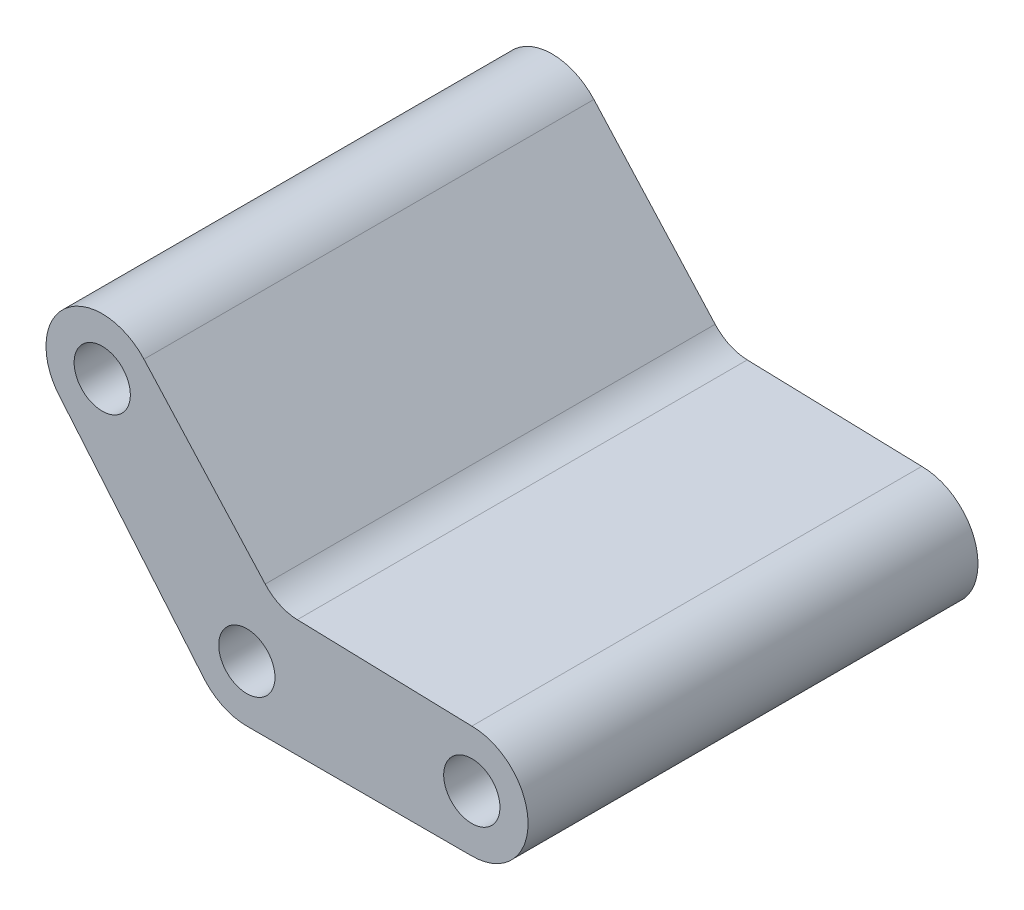
ISO-10303-21;
HEADER;
FILE_DESCRIPTION(('STEP AP214'),'2;1');
FILE_NAME('part.step','',(''),(''),'','','');
FILE_SCHEMA(('AUTOMOTIVE_DESIGN { 1 0 10303 214 1 1 1 1 }'));
ENDSEC;
DATA;
#1=APPLICATION_CONTEXT('core data for automotive mechanical design processes');
#2=APPLICATION_PROTOCOL_DEFINITION('international standard','automotive_design',2000,#1);
#3=PRODUCT_CONTEXT('',#1,'mechanical');
#4=PRODUCT('Part','Part','',(#3));
#5=PRODUCT_RELATED_PRODUCT_CATEGORY('part','',(#4));
#6=PRODUCT_DEFINITION_FORMATION('','',#4);
#7=PRODUCT_DEFINITION_CONTEXT('part definition',#1,'design');
#8=PRODUCT_DEFINITION('design','',#6,#7);
#9=PRODUCT_DEFINITION_SHAPE('','',#8);
#10=(LENGTH_UNIT() NAMED_UNIT(*) SI_UNIT(.MILLI.,.METRE.));
#11=(NAMED_UNIT(*) PLANE_ANGLE_UNIT() SI_UNIT($,.RADIAN.));
#12=(NAMED_UNIT(*) SI_UNIT($,.STERADIAN.) SOLID_ANGLE_UNIT());
#13=UNCERTAINTY_MEASURE_WITH_UNIT(LENGTH_MEASURE(1.E-05),#10,'distance_accuracy_value','');
#14=(GEOMETRIC_REPRESENTATION_CONTEXT(3) GLOBAL_UNCERTAINTY_ASSIGNED_CONTEXT((#13)) GLOBAL_UNIT_ASSIGNED_CONTEXT((#10,
#11,#12)) REPRESENTATION_CONTEXT('',''));
#15=CARTESIAN_POINT('',(0.,0.,0.));
#16=DIRECTION('',(0.,0.,1.));
#17=DIRECTION('',(1.,0.,0.));
#18=AXIS2_PLACEMENT_3D('',#15,#16,#17);
#19=CARTESIAN_POINT('',(45.9859991038776,94.3607755038972,400.));
#20=DIRECTION('',(0.,0.,-1.));
#21=DIRECTION('',(-1.,0.,0.));
#22=AXIS2_PLACEMENT_3D('',#19,#20,#21);
#23=CYLINDRICAL_SURFACE('',#22,40.);
#24=CARTESIAN_POINT('',(45.9859991038776,94.3607755038972,0.));
#25=DIRECTION('',(0.,0.,1.));
#26=DIRECTION('',(1.,0.,0.));
#27=AXIS2_PLACEMENT_3D('',#24,#25,#26);
#28=CIRCLE('',#27,40.);
#29=CARTESIAN_POINT('',(16.3159342561043,67.5337881231097,0.));
#30=VERTEX_POINT('',#29);
#31=CARTESIAN_POINT('',(44.858014963446,54.3766830197737,0.));
#32=VERTEX_POINT('',#31);
#33=EDGE_CURVE('E138',#30,#32,#28,.T.);
#34=ORIENTED_EDGE('',*,*,#33,.F.);
#35=DIRECTION('',(0.,0.,-1.));
#36=VECTOR('',#35,1.);
#37=CARTESIAN_POINT('',(16.3159342561043,67.5337881231097,400.));
#38=LINE('',#37,#36);
#39=CARTESIAN_POINT('',(16.3159342561043,67.5337881231097,400.));
#40=VERTEX_POINT('',#39);
#41=EDGE_CURVE('E11',#40,#30,#38,.T.);
#42=ORIENTED_EDGE('',*,*,#41,.F.);
#43=CARTESIAN_POINT('',(45.9859991038776,94.3607755038972,400.));
#44=DIRECTION('',(0.,0.,1.));
#45=DIRECTION('',(1.,0.,0.));
#46=AXIS2_PLACEMENT_3D('',#43,#44,#45);
#47=CIRCLE('',#46,40.);
#48=CARTESIAN_POINT('',(44.858014963446,54.3766830197737,400.));
#49=VERTEX_POINT('',#48);
#50=EDGE_CURVE('E165',#40,#49,#47,.T.);
#51=ORIENTED_EDGE('',*,*,#50,.T.);
#52=DIRECTION('',(0.,0.,-1.));
#53=VECTOR('',#52,1.);
#54=CARTESIAN_POINT('',(44.858014963446,54.3766830197737,400.));
#55=LINE('',#54,#53);
#56=EDGE_CURVE('E49',#49,#32,#55,.T.);
#57=ORIENTED_EDGE('',*,*,#56,.T.);
#58=EDGE_LOOP('',(#34,#42,#51,#57));
#59=FACE_BOUND('',#58,.T.);
#60=ADVANCED_FACE('F33',(#59),#23,.F.);
#61=CARTESIAN_POINT('',(42.5732591215961,38.4937576332859,400.));
#62=DIRECTION('',(-0.74175162119433,-0.670674684519689,0.));
#63=DIRECTION('',(0.670674684519689,-0.74175162119433,0.));
#64=AXIS2_PLACEMENT_3D('',#61,#62,#63);
#65=PLANE('',#64);
#66=DIRECTION('',(-0.670674684519689,0.74175162119433,0.));
#67=VECTOR('',#66,1.);
#68=CARTESIAN_POINT('',(42.5732591215961,38.4937576332859,0.));
#69=LINE('',#68,#67);
#70=CARTESIAN_POINT('',(-91.469940877592,186.742622849779,0.));
#71=VERTEX_POINT('',#70);
#72=EDGE_CURVE('E140',#30,#71,#69,.T.);
#73=ORIENTED_EDGE('',*,*,#72,.T.);
#74=DIRECTION('',(0.,0.,-1.));
#75=VECTOR('',#74,1.);
#76=CARTESIAN_POINT('',(-91.469940877592,186.742622849779,400.));
#77=LINE('',#76,#75);
#78=CARTESIAN_POINT('',(-91.469940877592,186.742622849779,400.));
#79=VERTEX_POINT('',#78);
#80=EDGE_CURVE('E41',#79,#71,#77,.T.);
#81=ORIENTED_EDGE('',*,*,#80,.F.);
#82=DIRECTION('',(-0.670674684519689,0.74175162119433,0.));
#83=VECTOR('',#82,1.);
#84=CARTESIAN_POINT('',(42.5732591215961,38.4937576332859,400.));
#85=LINE('',#84,#83);
#86=EDGE_CURVE('E192',#40,#79,#85,.T.);
#87=ORIENTED_EDGE('',*,*,#86,.F.);
#88=ORIENTED_EDGE('',*,*,#41,.T.);
#89=EDGE_LOOP('',(#73,#81,#87,#88));
#90=FACE_BOUND('',#89,.T.);
#91=ADVANCED_FACE('F212',(#90),#65,.F.);
#92=CARTESIAN_POINT('',(-128.557521937309,153.208888623795,400.));
#93=DIRECTION('',(0.,0.,-1.));
#94=DIRECTION('',(-1.,0.,0.));
#95=AXIS2_PLACEMENT_3D('',#92,#93,#94);
#96=CYLINDRICAL_SURFACE('',#95,50.);
#97=CARTESIAN_POINT('',(-128.557521937309,153.208888623795,0.));
#98=DIRECTION('',(0.,0.,1.));
#99=DIRECTION('',(1.,0.,0.));
#100=AXIS2_PLACEMENT_3D('',#97,#98,#99);
#101=CIRCLE('',#100,50.);
#102=CARTESIAN_POINT('',(-165.645102997025,119.675154397811,0.));
#103=VERTEX_POINT('',#102);
#104=EDGE_CURVE('E142',#71,#103,#101,.T.);
#105=ORIENTED_EDGE('',*,*,#104,.T.);
#106=DIRECTION('',(0.,0.,-1.));
#107=VECTOR('',#106,1.);
#108=CARTESIAN_POINT('',(-165.645102997025,119.675154397811,400.));
#109=LINE('',#108,#107);
#110=CARTESIAN_POINT('',(-165.645102997025,119.675154397811,400.));
#111=VERTEX_POINT('',#110);
#112=EDGE_CURVE('E171',#111,#103,#109,.T.);
#113=ORIENTED_EDGE('',*,*,#112,.F.);
#114=CARTESIAN_POINT('',(-128.557521937309,153.208888623795,400.));
#115=DIRECTION('',(0.,0.,1.));
#116=DIRECTION('',(1.,0.,0.));
#117=AXIS2_PLACEMENT_3D('',#114,#115,#116);
#118=CIRCLE('',#117,50.);
#119=EDGE_CURVE('E179',#79,#111,#118,.T.);
#120=ORIENTED_EDGE('',*,*,#119,.F.);
#121=ORIENTED_EDGE('',*,*,#80,.T.);
#122=EDGE_LOOP('',(#105,#113,#120,#121));
#123=FACE_BOUND('',#122,.T.);
#124=ADVANCED_FACE('F177',(#123),#96,.T.);
#125=CARTESIAN_POINT('',(-38.2760266890053,-32.1173998776764,400.));
#126=DIRECTION('',(-0.766044443118975,-0.642787609686543,0.));
#127=DIRECTION('',(0.642787609686543,-0.766044443118975,0.));
#128=AXIS2_PLACEMENT_3D('',#125,#126,#127);
#129=PLANE('',#128);
#130=DIRECTION('',(-0.642787609686543,0.766044443118975,0.));
#131=VECTOR('',#130,1.);
#132=CARTESIAN_POINT('',(-38.2760266890053,-32.1173998776764,0.));
#133=LINE('',#132,#131);
#134=CARTESIAN_POINT('',(-37.0875810597164,-33.5337342259844,0.));
#135=VERTEX_POINT('',#134);
#136=EDGE_CURVE('E145',#135,#103,#133,.T.);
#137=ORIENTED_EDGE('',*,*,#136,.F.);
#138=DIRECTION('',(0.,0.,-1.));
#139=VECTOR('',#138,1.);
#140=CARTESIAN_POINT('',(-37.0875810597164,-33.5337342259844,400.));
#141=LINE('',#140,#139);
#142=CARTESIAN_POINT('',(-37.0875810597164,-33.5337342259844,400.));
#143=VERTEX_POINT('',#142);
#144=EDGE_CURVE('E169',#143,#135,#141,.T.);
#145=ORIENTED_EDGE('',*,*,#144,.F.);
#146=DIRECTION('',(-0.642787609686543,0.766044443118975,0.));
#147=VECTOR('',#146,1.);
#148=CARTESIAN_POINT('',(-38.2760266890053,-32.1173998776764,400.));
#149=LINE('',#148,#147);
#150=EDGE_CURVE('E190',#143,#111,#149,.T.);
#151=ORIENTED_EDGE('',*,*,#150,.T.);
#152=ORIENTED_EDGE('',*,*,#112,.T.);
#153=EDGE_LOOP('',(#137,#145,#151,#152));
#154=FACE_BOUND('',#153,.T.);
#155=ADVANCED_FACE('F188',(#154),#129,.T.);
#156=CARTESIAN_POINT('',(0.,0.,400.));
#157=DIRECTION('',(0.,0.,-1.));
#158=DIRECTION('',(-1.,0.,0.));
#159=AXIS2_PLACEMENT_3D('',#156,#157,#158);
#160=CYLINDRICAL_SURFACE('',#159,50.);
#161=CARTESIAN_POINT('',(0.,0.,0.));
#162=DIRECTION('',(0.,0.,1.));
#163=DIRECTION('',(1.,0.,0.));
#164=AXIS2_PLACEMENT_3D('',#161,#162,#163);
#165=CIRCLE('',#164,50.);
#166=CARTESIAN_POINT('',(0.,-50.,0.));
#167=VERTEX_POINT('',#166);
#168=EDGE_CURVE('E148',#135,#167,#165,.T.);
#169=ORIENTED_EDGE('',*,*,#168,.T.);
#170=DIRECTION('',(0.,0.,-1.));
#171=VECTOR('',#170,1.);
#172=CARTESIAN_POINT('',(0.,-50.,400.));
#173=LINE('',#172,#171);
#174=CARTESIAN_POINT('',(0.,-50.,400.));
#175=VERTEX_POINT('',#174);
#176=EDGE_CURVE('E121',#175,#167,#173,.T.);
#177=ORIENTED_EDGE('',*,*,#176,.F.);
#178=CARTESIAN_POINT('',(0.,0.,400.));
#179=DIRECTION('',(0.,0.,1.));
#180=DIRECTION('',(1.,0.,0.));
#181=AXIS2_PLACEMENT_3D('',#178,#179,#180);
#182=CIRCLE('',#181,50.);
#183=EDGE_CURVE('E109',#143,#175,#182,.T.);
#184=ORIENTED_EDGE('',*,*,#183,.F.);
#185=ORIENTED_EDGE('',*,*,#144,.T.);
#186=EDGE_LOOP('',(#169,#177,#184,#185));
#187=FACE_BOUND('',#186,.T.);
#188=ADVANCED_FACE('F223',(#187),#160,.T.);
#189=CARTESIAN_POINT('',(0.,-50.,400.));
#190=DIRECTION('',(0.,1.,0.));
#191=DIRECTION('',(0.,0.,1.));
#192=AXIS2_PLACEMENT_3D('',#189,#190,#191);
#193=PLANE('',#192);
#194=DIRECTION('',(1.,0.,0.));
#195=VECTOR('',#194,1.);
#196=CARTESIAN_POINT('',(0.,-50.,0.));
#197=LINE('',#196,#195);
#198=CARTESIAN_POINT('',(200.,-50.,0.));
#199=VERTEX_POINT('',#198);
#200=EDGE_CURVE('E118',#167,#199,#197,.T.);
#201=ORIENTED_EDGE('',*,*,#200,.T.);
#202=DIRECTION('',(0.,0.,-1.));
#203=VECTOR('',#202,1.);
#204=CARTESIAN_POINT('',(200.,-50.,400.));
#205=LINE('',#204,#203);
#206=CARTESIAN_POINT('',(200.,-50.,400.));
#207=VERTEX_POINT('',#206);
#208=EDGE_CURVE('E115',#207,#199,#205,.T.);
#209=ORIENTED_EDGE('',*,*,#208,.F.);
#210=DIRECTION('',(1.,0.,0.));
#211=VECTOR('',#210,1.);
#212=CARTESIAN_POINT('',(0.,-50.,400.));
#213=LINE('',#212,#211);
#214=EDGE_CURVE('E99',#175,#207,#213,.T.);
#215=ORIENTED_EDGE('',*,*,#214,.F.);
#216=ORIENTED_EDGE('',*,*,#176,.T.);
#217=EDGE_LOOP('',(#201,#209,#215,#216));
#218=FACE_BOUND('',#217,.T.);
#219=ADVANCED_FACE('F116',(#218),#193,.F.);
#220=CARTESIAN_POINT('',(200.,0.,400.));
#221=DIRECTION('',(0.,0.,-1.));
#222=DIRECTION('',(-1.,0.,0.));
#223=AXIS2_PLACEMENT_3D('',#220,#221,#222);
#224=CYLINDRICAL_SURFACE('',#223,50.);
#225=CARTESIAN_POINT('',(200.,0.,0.));
#226=DIRECTION('',(0.,0.,1.));
#227=DIRECTION('',(1.,0.,0.));
#228=AXIS2_PLACEMENT_3D('',#225,#226,#227);
#229=CIRCLE('',#228,50.);
#230=CARTESIAN_POINT('',(200.,50.,0.));
#231=VERTEX_POINT('',#230);
#232=EDGE_CURVE('E151',#199,#231,#229,.T.);
#233=ORIENTED_EDGE('',*,*,#232,.T.);
#234=DIRECTION('',(0.,0.,-1.));
#235=VECTOR('',#234,1.);
#236=CARTESIAN_POINT('',(200.,50.,400.));
#237=LINE('',#236,#235);
#238=CARTESIAN_POINT('',(200.,50.,400.));
#239=VERTEX_POINT('',#238);
#240=EDGE_CURVE('E75',#239,#231,#237,.T.);
#241=ORIENTED_EDGE('',*,*,#240,.F.);
#242=CARTESIAN_POINT('',(200.,0.,400.));
#243=DIRECTION('',(0.,0.,1.));
#244=DIRECTION('',(1.,0.,0.));
#245=AXIS2_PLACEMENT_3D('',#242,#243,#244);
#246=CIRCLE('',#245,50.);
#247=EDGE_CURVE('E106',#207,#239,#246,.T.);
#248=ORIENTED_EDGE('',*,*,#247,.F.);
#249=ORIENTED_EDGE('',*,*,#208,.T.);
#250=EDGE_LOOP('',(#233,#241,#248,#249));
#251=FACE_BOUND('',#250,.T.);
#252=ADVANCED_FACE('F123',(#251),#224,.T.);
#253=CARTESIAN_POINT('',(1.11022302462516E-13,0.,400.));
#254=DIRECTION('',(0.,0.,-1.));
#255=DIRECTION('',(-1.,0.,0.));
#256=AXIS2_PLACEMENT_3D('',#253,#254,#255);
#257=CYLINDRICAL_SURFACE('',#256,25.);
#258=CARTESIAN_POINT('',(1.11022302462516E-13,0.,400.));
#259=DIRECTION('',(0.,0.,1.));
#260=DIRECTION('',(1.,0.,0.));
#261=AXIS2_PLACEMENT_3D('',#258,#259,#260);
#262=CIRCLE('',#261,25.);
#263=CARTESIAN_POINT('',(25.0000000000001,0.,400.));
#264=VERTEX_POINT('',#263);
#265=EDGE_CURVE('E132',#264,#264,#262,.T.);
#266=ORIENTED_EDGE('',*,*,#265,.T.);
#267=EDGE_LOOP('',(#266));
#268=FACE_BOUND('',#267,.T.);
#269=CARTESIAN_POINT('',(1.11022302462516E-13,0.,0.));
#270=DIRECTION('',(0.,0.,1.));
#271=DIRECTION('',(1.,0.,0.));
#272=AXIS2_PLACEMENT_3D('',#269,#270,#271);
#273=CIRCLE('',#272,25.);
#274=CARTESIAN_POINT('',(25.0000000000001,0.,0.));
#275=VERTEX_POINT('',#274);
#276=EDGE_CURVE('E159',#275,#275,#273,.T.);
#277=ORIENTED_EDGE('',*,*,#276,.F.);
#278=EDGE_LOOP('',(#277));
#279=FACE_BOUND('',#278,.T.);
#280=ADVANCED_FACE('F207',(#268,#279),#257,.F.);
#281=CARTESIAN_POINT('',(200.,0.,400.));
#282=DIRECTION('',(0.,0.,-1.));
#283=DIRECTION('',(-1.,0.,0.));
#284=AXIS2_PLACEMENT_3D('',#281,#282,#283);
#285=CYLINDRICAL_SURFACE('',#284,25.);
#286=CARTESIAN_POINT('',(200.,0.,400.));
#287=DIRECTION('',(0.,0.,1.));
#288=DIRECTION('',(1.,0.,0.));
#289=AXIS2_PLACEMENT_3D('',#286,#287,#288);
#290=CIRCLE('',#289,25.);
#291=CARTESIAN_POINT('',(225.,0.,400.));
#292=VERTEX_POINT('',#291);
#293=EDGE_CURVE('E126',#292,#292,#290,.T.);
#294=ORIENTED_EDGE('',*,*,#293,.T.);
#295=EDGE_LOOP('',(#294));
#296=FACE_BOUND('',#295,.T.);
#297=CARTESIAN_POINT('',(200.,0.,0.));
#298=DIRECTION('',(0.,0.,1.));
#299=DIRECTION('',(1.,0.,0.));
#300=AXIS2_PLACEMENT_3D('',#297,#298,#299);
#301=CIRCLE('',#300,25.);
#302=CARTESIAN_POINT('',(225.,0.,0.));
#303=VERTEX_POINT('',#302);
#304=EDGE_CURVE('E156',#303,#303,#301,.T.);
#305=ORIENTED_EDGE('',*,*,#304,.F.);
#306=EDGE_LOOP('',(#305));
#307=FACE_BOUND('',#306,.T.);
#308=ADVANCED_FACE('F199',(#296,#307),#285,.F.);
#309=CARTESIAN_POINT('',(1.56846297112211,55.5979168920474,400.));
#310=DIRECTION('',(0.0281996035107926,0.999602312103085,0.));
#311=DIRECTION('',(-0.999602312103085,0.0281996035107926,0.));
#312=AXIS2_PLACEMENT_3D('',#309,#310,#311);
#313=PLANE('',#312);
#314=DIRECTION('',(0.999602312103085,-0.0281996035107926,0.));
#315=VECTOR('',#314,1.);
#316=CARTESIAN_POINT('',(1.56846297112211,55.5979168920474,0.));
#317=LINE('',#316,#315);
#318=EDGE_CURVE('E153',#32,#231,#317,.T.);
#319=ORIENTED_EDGE('',*,*,#318,.F.);
#320=ORIENTED_EDGE('',*,*,#56,.F.);
#321=DIRECTION('',(0.999602312103085,-0.0281996035107926,0.));
#322=VECTOR('',#321,1.);
#323=CARTESIAN_POINT('',(1.56846297112211,55.5979168920474,400.));
#324=LINE('',#323,#322);
#325=EDGE_CURVE('E124',#49,#239,#324,.T.);
#326=ORIENTED_EDGE('',*,*,#325,.T.);
#327=ORIENTED_EDGE('',*,*,#240,.T.);
#328=EDGE_LOOP('',(#319,#320,#326,#327));
#329=FACE_BOUND('',#328,.T.);
#330=ADVANCED_FACE('F196',(#329),#313,.T.);
#331=CARTESIAN_POINT('',(-128.557521937309,153.208888623795,400.));
#332=DIRECTION('',(0.,0.,-1.));
#333=DIRECTION('',(-1.,0.,0.));
#334=AXIS2_PLACEMENT_3D('',#331,#332,#333);
#335=CYLINDRICAL_SURFACE('',#334,25.);
#336=CARTESIAN_POINT('',(-128.557521937309,153.208888623795,400.));
#337=DIRECTION('',(0.,0.,1.));
#338=DIRECTION('',(1.,0.,0.));
#339=AXIS2_PLACEMENT_3D('',#336,#337,#338);
#340=CIRCLE('',#339,25.);
#341=CARTESIAN_POINT('',(-103.557521937309,153.208888623795,400.));
#342=VERTEX_POINT('',#341);
#343=EDGE_CURVE('E135',#342,#342,#340,.T.);
#344=ORIENTED_EDGE('',*,*,#343,.T.);
#345=EDGE_LOOP('',(#344));
#346=FACE_BOUND('',#345,.T.);
#347=CARTESIAN_POINT('',(-128.557521937309,153.208888623795,0.));
#348=DIRECTION('',(0.,0.,1.));
#349=DIRECTION('',(1.,0.,0.));
#350=AXIS2_PLACEMENT_3D('',#347,#348,#349);
#351=CIRCLE('',#350,25.);
#352=CARTESIAN_POINT('',(-103.557521937309,153.208888623795,0.));
#353=VERTEX_POINT('',#352);
#354=EDGE_CURVE('E162',#353,#353,#351,.T.);
#355=ORIENTED_EDGE('',*,*,#354,.F.);
#356=EDGE_LOOP('',(#355));
#357=FACE_BOUND('',#356,.T.);
#358=ADVANCED_FACE('F198',(#346,#357),#335,.F.);
#359=CARTESIAN_POINT('',(0.,0.,400.));
#360=DIRECTION('',(0.,0.,1.));
#361=DIRECTION('',(1.,0.,0.));
#362=AXIS2_PLACEMENT_3D('',#359,#360,#361);
#363=PLANE('',#362);
#364=ORIENTED_EDGE('',*,*,#50,.F.);
#365=ORIENTED_EDGE('',*,*,#86,.T.);
#366=ORIENTED_EDGE('',*,*,#119,.T.);
#367=ORIENTED_EDGE('',*,*,#150,.F.);
#368=ORIENTED_EDGE('',*,*,#183,.T.);
#369=ORIENTED_EDGE('',*,*,#214,.T.);
#370=ORIENTED_EDGE('',*,*,#247,.T.);
#371=ORIENTED_EDGE('',*,*,#325,.F.);
#372=EDGE_LOOP('',(#364,#365,#366,#367,#368,#369,#370,#371));
#373=FACE_BOUND('',#372,.T.);
#374=ORIENTED_EDGE('',*,*,#293,.F.);
#375=EDGE_LOOP('',(#374));
#376=FACE_BOUND('',#375,.T.);
#377=ORIENTED_EDGE('',*,*,#265,.F.);
#378=EDGE_LOOP('',(#377));
#379=FACE_BOUND('',#378,.T.);
#380=ORIENTED_EDGE('',*,*,#343,.F.);
#381=EDGE_LOOP('',(#380));
#382=FACE_BOUND('',#381,.T.);
#383=ADVANCED_FACE('F102',(#373,#376,#379,#382),#363,.T.);
#384=CARTESIAN_POINT('',(0.,0.,0.));
#385=DIRECTION('',(0.,0.,1.));
#386=DIRECTION('',(1.,0.,0.));
#387=AXIS2_PLACEMENT_3D('',#384,#385,#386);
#388=PLANE('',#387);
#389=ORIENTED_EDGE('',*,*,#33,.T.);
#390=ORIENTED_EDGE('',*,*,#318,.T.);
#391=ORIENTED_EDGE('',*,*,#232,.F.);
#392=ORIENTED_EDGE('',*,*,#200,.F.);
#393=ORIENTED_EDGE('',*,*,#168,.F.);
#394=ORIENTED_EDGE('',*,*,#136,.T.);
#395=ORIENTED_EDGE('',*,*,#104,.F.);
#396=ORIENTED_EDGE('',*,*,#72,.F.);
#397=EDGE_LOOP('',(#389,#390,#391,#392,#393,#394,#395,#396));
#398=FACE_BOUND('',#397,.T.);
#399=ORIENTED_EDGE('',*,*,#304,.T.);
#400=EDGE_LOOP('',(#399));
#401=FACE_BOUND('',#400,.T.);
#402=ORIENTED_EDGE('',*,*,#276,.T.);
#403=EDGE_LOOP('',(#402));
#404=FACE_BOUND('',#403,.T.);
#405=ORIENTED_EDGE('',*,*,#354,.T.);
#406=EDGE_LOOP('',(#405));
#407=FACE_BOUND('',#406,.T.);
#408=ADVANCED_FACE('F183',(#398,#401,#404,#407),#388,.F.);
#409=CLOSED_SHELL('',(#60,#91,#124,#155,#188,#219,#252,#280,#308,#330,#358,#383,#408));
#410=MANIFOLD_SOLID_BREP('B2',#409);
#411=ADVANCED_BREP_SHAPE_REPRESENTATION('',(#18,#410),#14);
#412=SHAPE_DEFINITION_REPRESENTATION(#9,#411);
ENDSEC;
END-ISO-10303-21;
